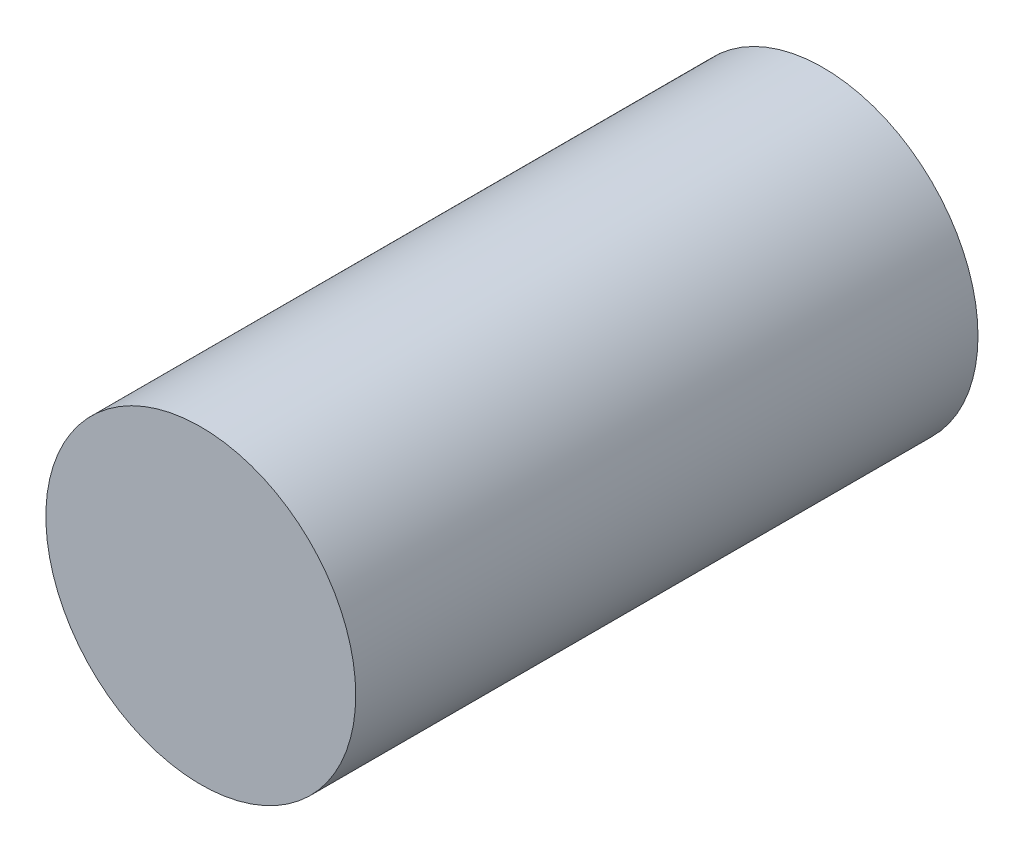
ISO-10303-21;
HEADER;
FILE_DESCRIPTION(('STEP AP214'),'2;1');
FILE_NAME('part.step','',(''),(''),'','','');
FILE_SCHEMA(('AUTOMOTIVE_DESIGN { 1 0 10303 214 1 1 1 1 }'));
ENDSEC;
DATA;
#1=APPLICATION_CONTEXT('core data for automotive mechanical design processes');
#2=APPLICATION_PROTOCOL_DEFINITION('international standard','automotive_design',2000,#1);
#3=PRODUCT_CONTEXT('',#1,'mechanical');
#4=PRODUCT('Part','Part','',(#3));
#5=PRODUCT_RELATED_PRODUCT_CATEGORY('part','',(#4));
#6=PRODUCT_DEFINITION_FORMATION('','',#4);
#7=PRODUCT_DEFINITION_CONTEXT('part definition',#1,'design');
#8=PRODUCT_DEFINITION('design','',#6,#7);
#9=PRODUCT_DEFINITION_SHAPE('','',#8);
#10=(LENGTH_UNIT() NAMED_UNIT(*) SI_UNIT(.MILLI.,.METRE.));
#11=(NAMED_UNIT(*) PLANE_ANGLE_UNIT() SI_UNIT($,.RADIAN.));
#12=(NAMED_UNIT(*) SI_UNIT($,.STERADIAN.) SOLID_ANGLE_UNIT());
#13=UNCERTAINTY_MEASURE_WITH_UNIT(LENGTH_MEASURE(1.E-05),#10,'distance_accuracy_value','');
#14=(GEOMETRIC_REPRESENTATION_CONTEXT(3) GLOBAL_UNCERTAINTY_ASSIGNED_CONTEXT((#13)) GLOBAL_UNIT_ASSIGNED_CONTEXT((#10,
#11,#12)) REPRESENTATION_CONTEXT('',''));
#15=CARTESIAN_POINT('',(0.,0.,0.));
#16=DIRECTION('',(0.,0.,1.));
#17=DIRECTION('',(1.,0.,0.));
#18=AXIS2_PLACEMENT_3D('',#15,#16,#17);
#19=CARTESIAN_POINT('',(0.,0.,10.));
#20=DIRECTION('',(0.,0.,-1.));
#21=DIRECTION('',(-1.,0.,0.));
#22=AXIS2_PLACEMENT_3D('',#19,#20,#21);
#23=CYLINDRICAL_SURFACE('',#22,2.49);
#24=CARTESIAN_POINT('',(0.,0.,10.));
#25=DIRECTION('',(0.,0.,1.));
#26=DIRECTION('',(1.,0.,0.));
#27=AXIS2_PLACEMENT_3D('',#24,#25,#26);
#28=CIRCLE('',#27,2.49);
#29=CARTESIAN_POINT('',(2.49,0.,10.));
#30=VERTEX_POINT('',#29);
#31=EDGE_CURVE('E10',#30,#30,#28,.T.);
#32=ORIENTED_EDGE('',*,*,#31,.F.);
#33=EDGE_LOOP('',(#32));
#34=FACE_BOUND('',#33,.T.);
#35=CARTESIAN_POINT('',(0.,0.,0.));
#36=DIRECTION('',(0.,0.,1.));
#37=DIRECTION('',(1.,0.,0.));
#38=AXIS2_PLACEMENT_3D('',#35,#36,#37);
#39=CIRCLE('',#38,2.49);
#40=CARTESIAN_POINT('',(2.49,0.,0.));
#41=VERTEX_POINT('',#40);
#42=EDGE_CURVE('E34',#41,#41,#39,.T.);
#43=ORIENTED_EDGE('',*,*,#42,.T.);
#44=EDGE_LOOP('',(#43));
#45=FACE_BOUND('',#44,.T.);
#46=ADVANCED_FACE('F31',(#34,#45),#23,.T.);
#47=CARTESIAN_POINT('',(0.,0.,10.));
#48=DIRECTION('',(0.,0.,1.));
#49=DIRECTION('',(1.,0.,0.));
#50=AXIS2_PLACEMENT_3D('',#47,#48,#49);
#51=PLANE('',#50);
#52=ORIENTED_EDGE('',*,*,#31,.T.);
#53=EDGE_LOOP('',(#52));
#54=FACE_BOUND('',#53,.T.);
#55=ADVANCED_FACE('F46',(#54),#51,.T.);
#56=CARTESIAN_POINT('',(0.,0.,0.));
#57=DIRECTION('',(0.,0.,1.));
#58=DIRECTION('',(1.,0.,0.));
#59=AXIS2_PLACEMENT_3D('',#56,#57,#58);
#60=PLANE('',#59);
#61=ORIENTED_EDGE('',*,*,#42,.F.);
#62=EDGE_LOOP('',(#61));
#63=FACE_BOUND('',#62,.T.);
#64=ADVANCED_FACE('F44',(#63),#60,.F.);
#65=CLOSED_SHELL('',(#46,#55,#64));
#66=MANIFOLD_SOLID_BREP('B2',#65);
#67=ADVANCED_BREP_SHAPE_REPRESENTATION('',(#18,#66),#14);
#68=SHAPE_DEFINITION_REPRESENTATION(#9,#67);
ENDSEC;
END-ISO-10303-21;
